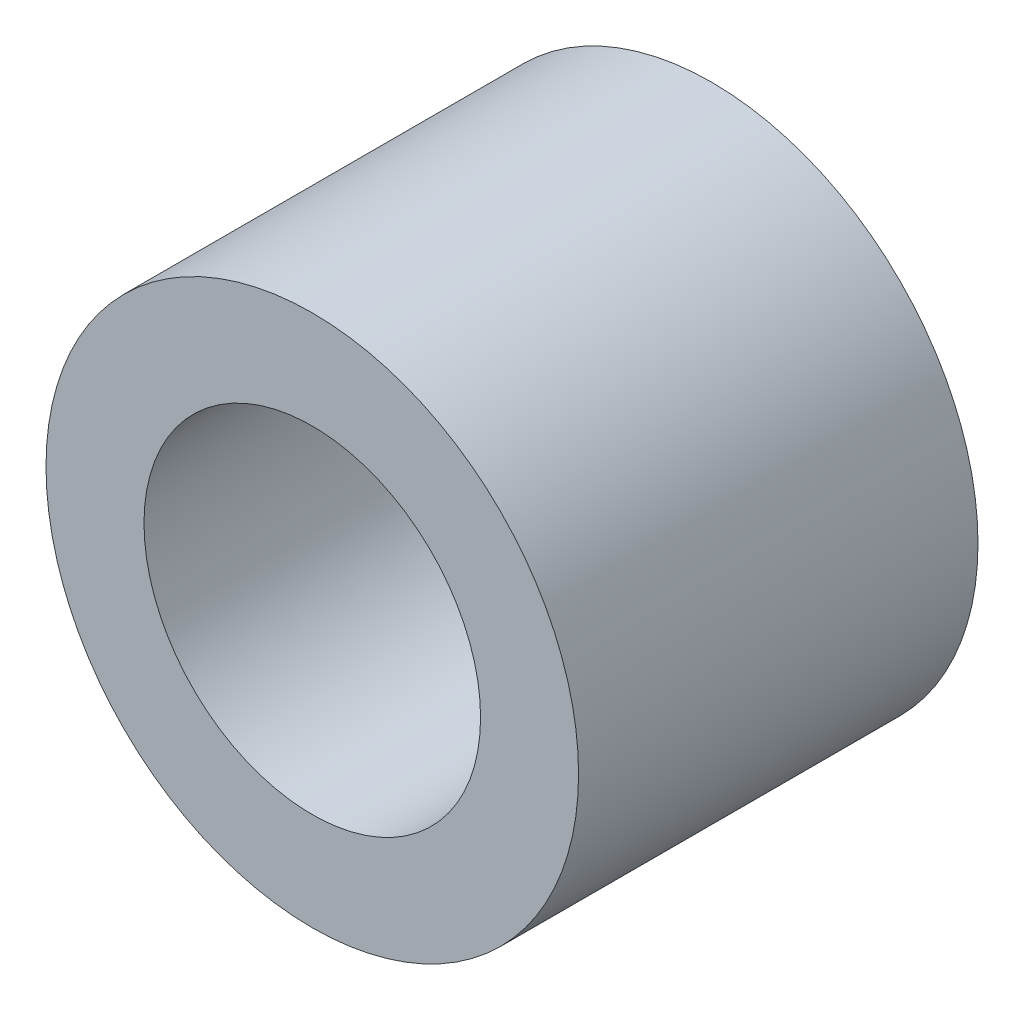
ISO-10303-21;
HEADER;
FILE_DESCRIPTION(('STEP AP214'),'2;1');
FILE_NAME('part.step','',(''),(''),'','','');
FILE_SCHEMA(('AUTOMOTIVE_DESIGN { 1 0 10303 214 1 1 1 1 }'));
ENDSEC;
DATA;
#1=APPLICATION_CONTEXT('core data for automotive mechanical design processes');
#2=APPLICATION_PROTOCOL_DEFINITION('international standard','automotive_design',2000,#1);
#3=PRODUCT_CONTEXT('',#1,'mechanical');
#4=PRODUCT('Part','Part','',(#3));
#5=PRODUCT_RELATED_PRODUCT_CATEGORY('part','',(#4));
#6=PRODUCT_DEFINITION_FORMATION('','',#4);
#7=PRODUCT_DEFINITION_CONTEXT('part definition',#1,'design');
#8=PRODUCT_DEFINITION('design','',#6,#7);
#9=PRODUCT_DEFINITION_SHAPE('','',#8);
#10=(LENGTH_UNIT() NAMED_UNIT(*) SI_UNIT(.MILLI.,.METRE.));
#11=(NAMED_UNIT(*) PLANE_ANGLE_UNIT() SI_UNIT($,.RADIAN.));
#12=(NAMED_UNIT(*) SI_UNIT($,.STERADIAN.) SOLID_ANGLE_UNIT());
#13=UNCERTAINTY_MEASURE_WITH_UNIT(LENGTH_MEASURE(1.E-05),#10,'distance_accuracy_value','');
#14=(GEOMETRIC_REPRESENTATION_CONTEXT(3) GLOBAL_UNCERTAINTY_ASSIGNED_CONTEXT((#13)) GLOBAL_UNIT_ASSIGNED_CONTEXT((#10,
#11,#12)) REPRESENTATION_CONTEXT('',''));
#15=CARTESIAN_POINT('',(0.,0.,0.));
#16=DIRECTION('',(0.,0.,1.));
#17=DIRECTION('',(1.,0.,0.));
#18=AXIS2_PLACEMENT_3D('',#15,#16,#17);
#19=CARTESIAN_POINT('',(0.,0.,4.7625));
#20=DIRECTION('',(0.,0.,1.));
#21=DIRECTION('',(1.,0.,0.));
#22=AXIS2_PLACEMENT_3D('',#19,#20,#21);
#23=PLANE('',#22);
#24=CARTESIAN_POINT('',(0.,0.,4.7625));
#25=DIRECTION('',(0.,0.,1.));
#26=DIRECTION('',(1.,0.,0.));
#27=AXIS2_PLACEMENT_3D('',#24,#25,#26);
#28=CIRCLE('',#27,6.35);
#29=CARTESIAN_POINT('',(6.35,0.,4.7625));
#30=VERTEX_POINT('',#29);
#31=EDGE_CURVE('E10',#30,#30,#28,.T.);
#32=ORIENTED_EDGE('',*,*,#31,.T.);
#33=EDGE_LOOP('',(#32));
#34=FACE_BOUND('',#33,.T.);
#35=CARTESIAN_POINT('',(0.,0.,4.7625));
#36=DIRECTION('',(0.,0.,1.));
#37=DIRECTION('',(1.,0.,0.));
#38=AXIS2_PLACEMENT_3D('',#35,#36,#37);
#39=CIRCLE('',#38,4.0132);
#40=CARTESIAN_POINT('',(4.0132,0.,4.7625));
#41=VERTEX_POINT('',#40);
#42=EDGE_CURVE('E41',#41,#41,#39,.T.);
#43=ORIENTED_EDGE('',*,*,#42,.F.);
#44=EDGE_LOOP('',(#43));
#45=FACE_BOUND('',#44,.T.);
#46=ADVANCED_FACE('F30',(#34,#45),#23,.T.);
#47=CARTESIAN_POINT('',(0.,0.,-4.7625));
#48=DIRECTION('',(0.,0.,1.));
#49=DIRECTION('',(1.,0.,0.));
#50=AXIS2_PLACEMENT_3D('',#47,#48,#49);
#51=PLANE('',#50);
#52=CARTESIAN_POINT('',(0.,0.,-4.7625));
#53=DIRECTION('',(0.,0.,1.));
#54=DIRECTION('',(1.,0.,0.));
#55=AXIS2_PLACEMENT_3D('',#52,#53,#54);
#56=CIRCLE('',#55,6.35);
#57=CARTESIAN_POINT('',(6.35,0.,-4.7625));
#58=VERTEX_POINT('',#57);
#59=EDGE_CURVE('E34',#58,#58,#56,.T.);
#60=ORIENTED_EDGE('',*,*,#59,.F.);
#61=EDGE_LOOP('',(#60));
#62=FACE_BOUND('',#61,.T.);
#63=CARTESIAN_POINT('',(0.,0.,-4.7625));
#64=DIRECTION('',(0.,0.,1.));
#65=DIRECTION('',(1.,0.,0.));
#66=AXIS2_PLACEMENT_3D('',#63,#64,#65);
#67=CIRCLE('',#66,4.0132);
#68=CARTESIAN_POINT('',(4.0132,0.,-4.7625));
#69=VERTEX_POINT('',#68);
#70=EDGE_CURVE('E43',#69,#69,#67,.T.);
#71=ORIENTED_EDGE('',*,*,#70,.T.);
#72=EDGE_LOOP('',(#71));
#73=FACE_BOUND('',#72,.T.);
#74=ADVANCED_FACE('F53',(#62,#73),#51,.F.);
#75=CARTESIAN_POINT('',(0.,0.,4.7625));
#76=DIRECTION('',(0.,0.,-1.));
#77=DIRECTION('',(-1.,0.,0.));
#78=AXIS2_PLACEMENT_3D('',#75,#76,#77);
#79=CYLINDRICAL_SURFACE('',#78,6.35);
#80=ORIENTED_EDGE('',*,*,#31,.F.);
#81=EDGE_LOOP('',(#80));
#82=FACE_BOUND('',#81,.T.);
#83=ORIENTED_EDGE('',*,*,#59,.T.);
#84=EDGE_LOOP('',(#83));
#85=FACE_BOUND('',#84,.T.);
#86=ADVANCED_FACE('F32',(#82,#85),#79,.T.);
#87=CARTESIAN_POINT('',(0.,0.,4.7625));
#88=DIRECTION('',(0.,0.,-1.));
#89=DIRECTION('',(-1.,0.,0.));
#90=AXIS2_PLACEMENT_3D('',#87,#88,#89);
#91=CYLINDRICAL_SURFACE('',#90,4.0132);
#92=ORIENTED_EDGE('',*,*,#42,.T.);
#93=EDGE_LOOP('',(#92));
#94=FACE_BOUND('',#93,.T.);
#95=ORIENTED_EDGE('',*,*,#70,.F.);
#96=EDGE_LOOP('',(#95));
#97=FACE_BOUND('',#96,.T.);
#98=ADVANCED_FACE('F49',(#94,#97),#91,.F.);
#99=CLOSED_SHELL('',(#46,#74,#86,#98));
#100=MANIFOLD_SOLID_BREP('B2',#99);
#101=ADVANCED_BREP_SHAPE_REPRESENTATION('',(#18,#100),#14);
#102=SHAPE_DEFINITION_REPRESENTATION(#9,#101);
ENDSEC;
END-ISO-10303-21;
